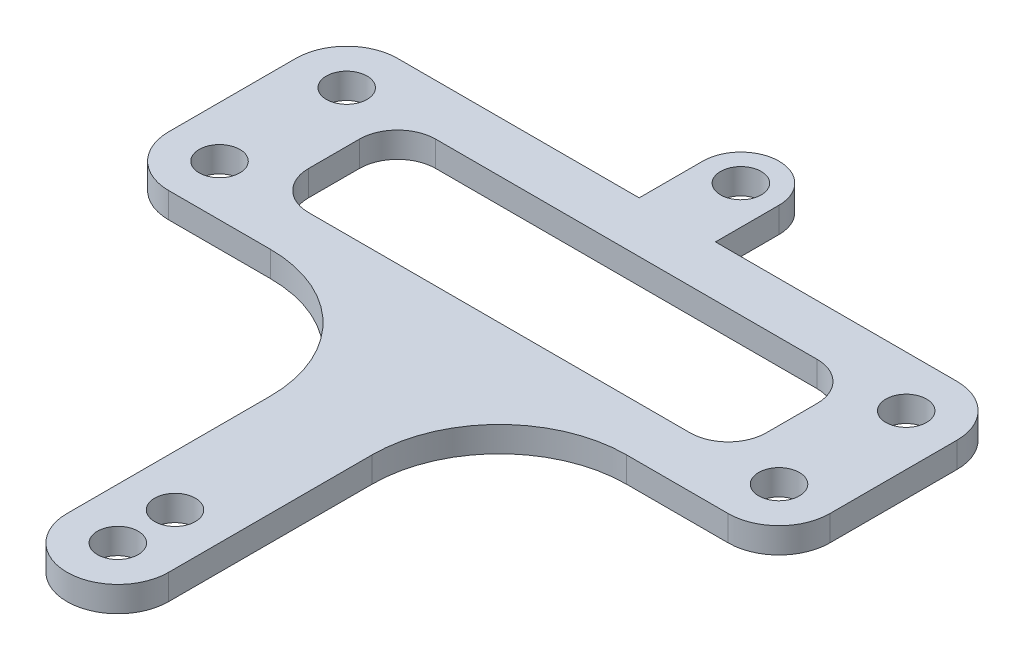
ISO-10303-21;
HEADER;
FILE_DESCRIPTION(('STEP AP214'),'2;1');
FILE_NAME('part.step','',(''),(''),'','','');
FILE_SCHEMA(('AUTOMOTIVE_DESIGN { 1 0 10303 214 1 1 1 1 }'));
ENDSEC;
DATA;
#1=APPLICATION_CONTEXT('core data for automotive mechanical design processes');
#2=APPLICATION_PROTOCOL_DEFINITION('international standard','automotive_design',2000,#1);
#3=PRODUCT_CONTEXT('',#1,'mechanical');
#4=PRODUCT('Part','Part','',(#3));
#5=PRODUCT_RELATED_PRODUCT_CATEGORY('part','',(#4));
#6=PRODUCT_DEFINITION_FORMATION('','',#4);
#7=PRODUCT_DEFINITION_CONTEXT('part definition',#1,'design');
#8=PRODUCT_DEFINITION('design','',#6,#7);
#9=PRODUCT_DEFINITION_SHAPE('','',#8);
#10=(LENGTH_UNIT() NAMED_UNIT(*) SI_UNIT(.MILLI.,.METRE.));
#11=(NAMED_UNIT(*) PLANE_ANGLE_UNIT() SI_UNIT($,.RADIAN.));
#12=(NAMED_UNIT(*) SI_UNIT($,.STERADIAN.) SOLID_ANGLE_UNIT());
#13=UNCERTAINTY_MEASURE_WITH_UNIT(LENGTH_MEASURE(1.E-05),#10,'distance_accuracy_value','');
#14=(GEOMETRIC_REPRESENTATION_CONTEXT(3) GLOBAL_UNCERTAINTY_ASSIGNED_CONTEXT((#13)) GLOBAL_UNIT_ASSIGNED_CONTEXT((#10,
#11,#12)) REPRESENTATION_CONTEXT('',''));
#15=CARTESIAN_POINT('',(0.,0.,0.));
#16=DIRECTION('',(0.,0.,1.));
#17=DIRECTION('',(1.,0.,0.));
#18=AXIS2_PLACEMENT_3D('',#15,#16,#17);
#19=CARTESIAN_POINT('',(0.,2.,0.));
#20=DIRECTION('',(0.,1.,0.));
#21=DIRECTION('',(0.,0.,1.));
#22=AXIS2_PLACEMENT_3D('',#19,#20,#21);
#23=PLANE('',#22);
#24=CARTESIAN_POINT('',(0.,2.,40.5));
#25=DIRECTION('',(0.,1.,0.));
#26=DIRECTION('',(0.,0.,1.));
#27=AXIS2_PLACEMENT_3D('',#24,#25,#26);
#28=CIRCLE('',#27,1.6);
#29=CARTESIAN_POINT('',(0.,2.,42.1));
#30=VERTEX_POINT('',#29);
#31=EDGE_CURVE('E943',#30,#30,#28,.T.);
#32=ORIENTED_EDGE('',*,*,#31,.F.);
#33=EDGE_LOOP('',(#32));
#34=FACE_BOUND('',#33,.T.);
#35=CARTESIAN_POINT('',(0.,2.,45.));
#36=DIRECTION('',(0.,1.,0.));
#37=DIRECTION('',(0.,0.,1.));
#38=AXIS2_PLACEMENT_3D('',#35,#36,#37);
#39=CIRCLE('',#38,1.6);
#40=CARTESIAN_POINT('',(0.,2.,46.6));
#41=VERTEX_POINT('',#40);
#42=EDGE_CURVE('E948',#41,#41,#39,.T.);
#43=ORIENTED_EDGE('',*,*,#42,.F.);
#44=EDGE_LOOP('',(#43));
#45=FACE_BOUND('',#44,.T.);
#46=CARTESIAN_POINT('',(-14.,2.,29.));
#47=DIRECTION('',(0.,1.,0.));
#48=DIRECTION('',(0.,0.,1.));
#49=AXIS2_PLACEMENT_3D('',#46,#47,#48);
#50=CIRCLE('',#49,10.);
#51=CARTESIAN_POINT('',(-14.,2.,19.));
#52=VERTEX_POINT('',#51);
#53=CARTESIAN_POINT('',(-4.,2.,29.));
#54=VERTEX_POINT('',#53);
#55=EDGE_CURVE('E416',#52,#54,#50,.F.);
#56=ORIENTED_EDGE('',*,*,#55,.T.);
#57=DIRECTION('',(0.,0.,-1.));
#58=VECTOR('',#57,1.);
#59=CARTESIAN_POINT('',(-3.99999999999999,2.,0.));
#60=LINE('',#59,#58);
#61=CARTESIAN_POINT('',(-4.,2.,45.));
#62=VERTEX_POINT('',#61);
#63=EDGE_CURVE('E303',#62,#54,#60,.T.);
#64=ORIENTED_EDGE('',*,*,#63,.F.);
#65=CARTESIAN_POINT('',(0.,2.,45.));
#66=DIRECTION('',(0.,1.,0.));
#67=DIRECTION('',(0.,0.,1.));
#68=AXIS2_PLACEMENT_3D('',#65,#66,#67);
#69=CIRCLE('',#68,4.);
#70=CARTESIAN_POINT('',(4.,2.,45.));
#71=VERTEX_POINT('',#70);
#72=EDGE_CURVE('E306',#62,#71,#69,.T.);
#73=ORIENTED_EDGE('',*,*,#72,.T.);
#74=DIRECTION('',(0.,0.,-1.));
#75=VECTOR('',#74,1.);
#76=CARTESIAN_POINT('',(4.00000000000001,2.,0.));
#77=LINE('',#76,#75);
#78=CARTESIAN_POINT('',(4.,2.,29.));
#79=VERTEX_POINT('',#78);
#80=EDGE_CURVE('E309',#71,#79,#77,.T.);
#81=ORIENTED_EDGE('',*,*,#80,.T.);
#82=CARTESIAN_POINT('',(14.,2.,29.));
#83=DIRECTION('',(0.,1.,0.));
#84=DIRECTION('',(0.,0.,1.));
#85=AXIS2_PLACEMENT_3D('',#82,#83,#84);
#86=CIRCLE('',#85,10.);
#87=CARTESIAN_POINT('',(14.,2.,19.));
#88=VERTEX_POINT('',#87);
#89=EDGE_CURVE('E420',#79,#88,#86,.F.);
#90=ORIENTED_EDGE('',*,*,#89,.T.);
#91=DIRECTION('',(-1.,0.,0.));
#92=VECTOR('',#91,1.);
#93=CARTESIAN_POINT('',(0.,2.,19.));
#94=LINE('',#93,#92);
#95=CARTESIAN_POINT('',(22.,2.,19.));
#96=VERTEX_POINT('',#95);
#97=EDGE_CURVE('E312',#96,#88,#94,.T.);
#98=ORIENTED_EDGE('',*,*,#97,.F.);
#99=CARTESIAN_POINT('',(22.,2.,15.));
#100=DIRECTION('',(0.,1.,0.));
#101=DIRECTION('',(0.,0.,1.));
#102=AXIS2_PLACEMENT_3D('',#99,#100,#101);
#103=CIRCLE('',#102,4.);
#104=CARTESIAN_POINT('',(26.,2.,15.));
#105=VERTEX_POINT('',#104);
#106=EDGE_CURVE('E315',#96,#105,#103,.T.);
#107=ORIENTED_EDGE('',*,*,#106,.T.);
#108=DIRECTION('',(0.,0.,1.));
#109=VECTOR('',#108,1.);
#110=CARTESIAN_POINT('',(26.,2.,0.));
#111=LINE('',#110,#109);
#112=CARTESIAN_POINT('',(26.,2.,5.));
#113=VERTEX_POINT('',#112);
#114=EDGE_CURVE('E317',#113,#105,#111,.T.);
#115=ORIENTED_EDGE('',*,*,#114,.F.);
#116=CARTESIAN_POINT('',(22.,2.,5.));
#117=DIRECTION('',(0.,1.,0.));
#118=DIRECTION('',(0.,0.,1.));
#119=AXIS2_PLACEMENT_3D('',#116,#117,#118);
#120=CIRCLE('',#119,4.);
#121=CARTESIAN_POINT('',(22.,2.,1.));
#122=VERTEX_POINT('',#121);
#123=EDGE_CURVE('E320',#113,#122,#120,.T.);
#124=ORIENTED_EDGE('',*,*,#123,.T.);
#125=DIRECTION('',(-1.,0.,0.));
#126=VECTOR('',#125,1.);
#127=CARTESIAN_POINT('',(0.,2.,1.));
#128=LINE('',#127,#126);
#129=CARTESIAN_POINT('',(3.,2.,1.));
#130=VERTEX_POINT('',#129);
#131=EDGE_CURVE('E243',#122,#130,#128,.T.);
#132=ORIENTED_EDGE('',*,*,#131,.T.);
#133=DIRECTION('',(0.,0.,-1.));
#134=VECTOR('',#133,1.);
#135=CARTESIAN_POINT('',(3.,2.,1.));
#136=LINE('',#135,#134);
#137=CARTESIAN_POINT('',(3.,2.,-4.));
#138=VERTEX_POINT('',#137);
#139=EDGE_CURVE('E236',#130,#138,#136,.T.);
#140=ORIENTED_EDGE('',*,*,#139,.T.);
#141=CARTESIAN_POINT('',(0.,2.,-4.));
#142=DIRECTION('',(0.,1.,0.));
#143=DIRECTION('',(0.,0.,1.));
#144=AXIS2_PLACEMENT_3D('',#141,#142,#143);
#145=CIRCLE('',#144,3.);
#146=CARTESIAN_POINT('',(-3.,2.,-4.));
#147=VERTEX_POINT('',#146);
#148=EDGE_CURVE('E241',#138,#147,#145,.T.);
#149=ORIENTED_EDGE('',*,*,#148,.T.);
#150=DIRECTION('',(0.,0.,1.));
#151=VECTOR('',#150,1.);
#152=CARTESIAN_POINT('',(-3.,2.,1.00000000000002));
#153=LINE('',#152,#151);
#154=CARTESIAN_POINT('',(-3.,2.,1.00000000000002));
#155=VERTEX_POINT('',#154);
#156=EDGE_CURVE('E246',#147,#155,#153,.T.);
#157=ORIENTED_EDGE('',*,*,#156,.T.);
#158=CARTESIAN_POINT('',(-22.,2.,1.00000000000001));
#159=VERTEX_POINT('',#158);
#160=EDGE_CURVE('E322',#155,#159,#128,.T.);
#161=ORIENTED_EDGE('',*,*,#160,.T.);
#162=CARTESIAN_POINT('',(-22.,2.,5.00000000000001));
#163=DIRECTION('',(0.,1.,0.));
#164=DIRECTION('',(0.,0.,1.));
#165=AXIS2_PLACEMENT_3D('',#162,#163,#164);
#166=CIRCLE('',#165,4.);
#167=CARTESIAN_POINT('',(-26.,2.,5.00000000000001));
#168=VERTEX_POINT('',#167);
#169=EDGE_CURVE('E324',#168,#159,#166,.F.);
#170=ORIENTED_EDGE('',*,*,#169,.F.);
#171=DIRECTION('',(0.,0.,1.));
#172=VECTOR('',#171,1.);
#173=CARTESIAN_POINT('',(-26.,2.,0.));
#174=LINE('',#173,#172);
#175=CARTESIAN_POINT('',(-26.,2.,15.));
#176=VERTEX_POINT('',#175);
#177=EDGE_CURVE('E327',#168,#176,#174,.T.);
#178=ORIENTED_EDGE('',*,*,#177,.T.);
#179=CARTESIAN_POINT('',(-22.,2.,15.));
#180=DIRECTION('',(0.,1.,0.));
#181=DIRECTION('',(0.,0.,1.));
#182=AXIS2_PLACEMENT_3D('',#179,#180,#181);
#183=CIRCLE('',#182,4.);
#184=CARTESIAN_POINT('',(-22.,2.,19.));
#185=VERTEX_POINT('',#184);
#186=EDGE_CURVE('E329',#185,#176,#183,.F.);
#187=ORIENTED_EDGE('',*,*,#186,.F.);
#188=DIRECTION('',(1.,0.,0.));
#189=VECTOR('',#188,1.);
#190=CARTESIAN_POINT('',(0.,2.,19.));
#191=LINE('',#190,#189);
#192=EDGE_CURVE('E332',#185,#52,#191,.T.);
#193=ORIENTED_EDGE('',*,*,#192,.T.);
#194=EDGE_LOOP('',(#56,#64,#73,#81,#90,#98,#107,#115,#124,#132,#140,#149,#157,#161,#170,#178,
#187,#193));
#195=FACE_BOUND('',#194,.T.);
#196=CARTESIAN_POINT('',(0.,2.,-4.));
#197=DIRECTION('',(0.,1.,0.));
#198=DIRECTION('',(0.,0.,1.));
#199=AXIS2_PLACEMENT_3D('',#196,#197,#198);
#200=CIRCLE('',#199,1.6);
#201=CARTESIAN_POINT('',(0.,2.,-2.4));
#202=VERTEX_POINT('',#201);
#203=EDGE_CURVE('E265',#202,#202,#200,.T.);
#204=ORIENTED_EDGE('',*,*,#203,.F.);
#205=EDGE_LOOP('',(#204));
#206=FACE_BOUND('',#205,.T.);
#207=CARTESIAN_POINT('',(-22.,2.,5.00000000000001));
#208=DIRECTION('',(0.,1.,0.));
#209=DIRECTION('',(0.,0.,1.));
#210=AXIS2_PLACEMENT_3D('',#207,#208,#209);
#211=CIRCLE('',#210,1.6);
#212=CARTESIAN_POINT('',(-22.,2.,6.60000000000001));
#213=VERTEX_POINT('',#212);
#214=EDGE_CURVE('E290',#213,#213,#211,.F.);
#215=ORIENTED_EDGE('',*,*,#214,.T.);
#216=EDGE_LOOP('',(#215));
#217=FACE_BOUND('',#216,.T.);
#218=CARTESIAN_POINT('',(22.,2.,5.));
#219=DIRECTION('',(0.,1.,0.));
#220=DIRECTION('',(0.,0.,1.));
#221=AXIS2_PLACEMENT_3D('',#218,#219,#220);
#222=CIRCLE('',#221,1.6);
#223=CARTESIAN_POINT('',(22.,2.,6.6));
#224=VERTEX_POINT('',#223);
#225=EDGE_CURVE('E293',#224,#224,#222,.T.);
#226=ORIENTED_EDGE('',*,*,#225,.F.);
#227=EDGE_LOOP('',(#226));
#228=FACE_BOUND('',#227,.T.);
#229=CARTESIAN_POINT('',(22.,2.,15.));
#230=DIRECTION('',(0.,1.,0.));
#231=DIRECTION('',(0.,0.,1.));
#232=AXIS2_PLACEMENT_3D('',#229,#230,#231);
#233=CIRCLE('',#232,1.6);
#234=CARTESIAN_POINT('',(22.,2.,16.6));
#235=VERTEX_POINT('',#234);
#236=EDGE_CURVE('E297',#235,#235,#233,.T.);
#237=ORIENTED_EDGE('',*,*,#236,.F.);
#238=EDGE_LOOP('',(#237));
#239=FACE_BOUND('',#238,.T.);
#240=CARTESIAN_POINT('',(-22.,2.,15.));
#241=DIRECTION('',(0.,1.,0.));
#242=DIRECTION('',(0.,0.,1.));
#243=AXIS2_PLACEMENT_3D('',#240,#241,#242);
#244=CIRCLE('',#243,1.6);
#245=CARTESIAN_POINT('',(-22.,2.,16.6));
#246=VERTEX_POINT('',#245);
#247=EDGE_CURVE('E300',#246,#246,#244,.F.);
#248=ORIENTED_EDGE('',*,*,#247,.T.);
#249=EDGE_LOOP('',(#248));
#250=FACE_BOUND('',#249,.T.);
#251=DIRECTION('',(0.,0.,1.));
#252=VECTOR('',#251,1.);
#253=CARTESIAN_POINT('',(-18.,2.,0.));
#254=LINE('',#253,#252);
#255=CARTESIAN_POINT('',(-18.,2.,8.00000000000001));
#256=VERTEX_POINT('',#255);
#257=CARTESIAN_POINT('',(-18.,2.,12.));
#258=VERTEX_POINT('',#257);
#259=EDGE_CURVE('E277',#256,#258,#254,.T.);
#260=ORIENTED_EDGE('',*,*,#259,.F.);
#261=CARTESIAN_POINT('',(-15.,2.,8.00000000000001));
#262=DIRECTION('',(0.,1.,0.));
#263=DIRECTION('',(0.,0.,1.));
#264=AXIS2_PLACEMENT_3D('',#261,#262,#263);
#265=CIRCLE('',#264,3.);
#266=CARTESIAN_POINT('',(-15.,2.,5.));
#267=VERTEX_POINT('',#266);
#268=EDGE_CURVE('E70',#256,#267,#265,.F.);
#269=ORIENTED_EDGE('',*,*,#268,.T.);
#270=DIRECTION('',(1.,0.,0.));
#271=VECTOR('',#270,1.);
#272=CARTESIAN_POINT('',(0.,2.,5.));
#273=LINE('',#272,#271);
#274=CARTESIAN_POINT('',(15.,2.,5.));
#275=VERTEX_POINT('',#274);
#276=EDGE_CURVE('E271',#267,#275,#273,.T.);
#277=ORIENTED_EDGE('',*,*,#276,.T.);
#278=CARTESIAN_POINT('',(15.,2.,8.));
#279=DIRECTION('',(0.,1.,0.));
#280=DIRECTION('',(0.,0.,1.));
#281=AXIS2_PLACEMENT_3D('',#278,#279,#280);
#282=CIRCLE('',#281,3.);
#283=CARTESIAN_POINT('',(18.,2.,8.));
#284=VERTEX_POINT('',#283);
#285=EDGE_CURVE('E452',#275,#284,#282,.F.);
#286=ORIENTED_EDGE('',*,*,#285,.T.);
#287=DIRECTION('',(0.,0.,1.));
#288=VECTOR('',#287,1.);
#289=CARTESIAN_POINT('',(18.,2.,0.));
#290=LINE('',#289,#288);
#291=CARTESIAN_POINT('',(18.,2.,12.));
#292=VERTEX_POINT('',#291);
#293=EDGE_CURVE('E282',#284,#292,#290,.T.);
#294=ORIENTED_EDGE('',*,*,#293,.T.);
#295=CARTESIAN_POINT('',(15.,2.,12.));
#296=DIRECTION('',(0.,1.,0.));
#297=DIRECTION('',(0.,0.,1.));
#298=AXIS2_PLACEMENT_3D('',#295,#296,#297);
#299=CIRCLE('',#298,3.);
#300=CARTESIAN_POINT('',(15.,2.,15.));
#301=VERTEX_POINT('',#300);
#302=EDGE_CURVE('E456',#292,#301,#299,.F.);
#303=ORIENTED_EDGE('',*,*,#302,.T.);
#304=DIRECTION('',(-1.,0.,0.));
#305=VECTOR('',#304,1.);
#306=CARTESIAN_POINT('',(0.,2.,15.));
#307=LINE('',#306,#305);
#308=CARTESIAN_POINT('',(-15.,2.,15.));
#309=VERTEX_POINT('',#308);
#310=EDGE_CURVE('E279',#301,#309,#307,.T.);
#311=ORIENTED_EDGE('',*,*,#310,.T.);
#312=CARTESIAN_POINT('',(-15.,2.,12.));
#313=DIRECTION('',(0.,1.,0.));
#314=DIRECTION('',(0.,0.,1.));
#315=AXIS2_PLACEMENT_3D('',#312,#313,#314);
#316=CIRCLE('',#315,3.);
#317=EDGE_CURVE('E460',#309,#258,#316,.F.);
#318=ORIENTED_EDGE('',*,*,#317,.T.);
#319=EDGE_LOOP('',(#260,#269,#277,#286,#294,#303,#311,#318));
#320=FACE_BOUND('',#319,.T.);
#321=ADVANCED_FACE('F61',(#34,#45,#195,#206,#217,#228,#239,#250,#320),#23,.T.);
#322=CARTESIAN_POINT('',(0.,0.,0.));
#323=DIRECTION('',(0.,1.,0.));
#324=DIRECTION('',(0.,0.,1.));
#325=AXIS2_PLACEMENT_3D('',#322,#323,#324);
#326=PLANE('',#325);
#327=CARTESIAN_POINT('',(0.,0.,40.5));
#328=DIRECTION('',(0.,-1.,0.));
#329=DIRECTION('',(0.,0.,-1.));
#330=AXIS2_PLACEMENT_3D('',#327,#328,#329);
#331=CIRCLE('',#330,1.6);
#332=CARTESIAN_POINT('',(0.,0.,38.9));
#333=VERTEX_POINT('',#332);
#334=EDGE_CURVE('E946',#333,#333,#331,.T.);
#335=ORIENTED_EDGE('',*,*,#334,.F.);
#336=EDGE_LOOP('',(#335));
#337=FACE_BOUND('',#336,.T.);
#338=CARTESIAN_POINT('',(0.,0.,45.));
#339=DIRECTION('',(0.,1.,0.));
#340=DIRECTION('',(0.,0.,1.));
#341=AXIS2_PLACEMENT_3D('',#338,#339,#340);
#342=CIRCLE('',#341,1.6);
#343=CARTESIAN_POINT('',(0.,0.,46.6));
#344=VERTEX_POINT('',#343);
#345=EDGE_CURVE('E65',#344,#344,#342,.T.);
#346=ORIENTED_EDGE('',*,*,#345,.T.);
#347=EDGE_LOOP('',(#346));
#348=FACE_BOUND('',#347,.T.);
#349=DIRECTION('',(0.,0.,-1.));
#350=VECTOR('',#349,1.);
#351=CARTESIAN_POINT('',(-3.99999999999999,0.,0.));
#352=LINE('',#351,#350);
#353=CARTESIAN_POINT('',(-4.,0.,45.));
#354=VERTEX_POINT('',#353);
#355=CARTESIAN_POINT('',(-4.,0.,29.));
#356=VERTEX_POINT('',#355);
#357=EDGE_CURVE('E347',#354,#356,#352,.T.);
#358=ORIENTED_EDGE('',*,*,#357,.T.);
#359=CARTESIAN_POINT('',(-14.,0.,29.));
#360=DIRECTION('',(0.,1.,0.));
#361=DIRECTION('',(0.,0.,1.));
#362=AXIS2_PLACEMENT_3D('',#359,#360,#361);
#363=CIRCLE('',#362,10.);
#364=CARTESIAN_POINT('',(-14.,0.,19.));
#365=VERTEX_POINT('',#364);
#366=EDGE_CURVE('E414',#356,#365,#363,.T.);
#367=ORIENTED_EDGE('',*,*,#366,.T.);
#368=DIRECTION('',(1.,0.,0.));
#369=VECTOR('',#368,1.);
#370=CARTESIAN_POINT('',(0.,0.,19.));
#371=LINE('',#370,#369);
#372=CARTESIAN_POINT('',(-22.,0.,19.));
#373=VERTEX_POINT('',#372);
#374=EDGE_CURVE('E294',#373,#365,#371,.T.);
#375=ORIENTED_EDGE('',*,*,#374,.F.);
#376=CARTESIAN_POINT('',(-22.,0.,15.));
#377=DIRECTION('',(0.,1.,0.));
#378=DIRECTION('',(0.,0.,1.));
#379=AXIS2_PLACEMENT_3D('',#376,#377,#378);
#380=CIRCLE('',#379,4.);
#381=CARTESIAN_POINT('',(-26.,0.,15.));
#382=VERTEX_POINT('',#381);
#383=EDGE_CURVE('E378',#373,#382,#380,.F.);
#384=ORIENTED_EDGE('',*,*,#383,.T.);
#385=DIRECTION('',(0.,0.,1.));
#386=VECTOR('',#385,1.);
#387=CARTESIAN_POINT('',(-26.,0.,0.));
#388=LINE('',#387,#386);
#389=CARTESIAN_POINT('',(-26.,0.,5.00000000000001));
#390=VERTEX_POINT('',#389);
#391=EDGE_CURVE('E375',#390,#382,#388,.T.);
#392=ORIENTED_EDGE('',*,*,#391,.F.);
#393=CARTESIAN_POINT('',(-22.,0.,5.00000000000001));
#394=DIRECTION('',(0.,1.,0.));
#395=DIRECTION('',(0.,0.,1.));
#396=AXIS2_PLACEMENT_3D('',#393,#394,#395);
#397=CIRCLE('',#396,4.);
#398=CARTESIAN_POINT('',(-22.,0.,1.00000000000001));
#399=VERTEX_POINT('',#398);
#400=EDGE_CURVE('E372',#390,#399,#397,.F.);
#401=ORIENTED_EDGE('',*,*,#400,.T.);
#402=DIRECTION('',(1.,0.,0.));
#403=VECTOR('',#402,1.);
#404=CARTESIAN_POINT('',(0.,0.,1.));
#405=LINE('',#404,#403);
#406=CARTESIAN_POINT('',(-3.,0.,1.00000000000002));
#407=VERTEX_POINT('',#406);
#408=EDGE_CURVE('E369',#399,#407,#405,.T.);
#409=ORIENTED_EDGE('',*,*,#408,.T.);
#410=DIRECTION('',(0.,0.,-1.));
#411=VECTOR('',#410,1.);
#412=CARTESIAN_POINT('',(-3.,0.,1.00000000000002));
#413=LINE('',#412,#411);
#414=CARTESIAN_POINT('',(-3.,0.,-4.));
#415=VERTEX_POINT('',#414);
#416=EDGE_CURVE('E272',#407,#415,#413,.T.);
#417=ORIENTED_EDGE('',*,*,#416,.T.);
#418=CARTESIAN_POINT('',(0.,0.,-4.));
#419=DIRECTION('',(0.,1.,0.));
#420=DIRECTION('',(0.,0.,1.));
#421=AXIS2_PLACEMENT_3D('',#418,#419,#420);
#422=CIRCLE('',#421,3.);
#423=CARTESIAN_POINT('',(3.,0.,-4.));
#424=VERTEX_POINT('',#423);
#425=EDGE_CURVE('E247',#415,#424,#422,.F.);
#426=ORIENTED_EDGE('',*,*,#425,.T.);
#427=DIRECTION('',(0.,0.,1.));
#428=VECTOR('',#427,1.);
#429=CARTESIAN_POINT('',(3.,0.,1.));
#430=LINE('',#429,#428);
#431=CARTESIAN_POINT('',(3.,0.,1.));
#432=VERTEX_POINT('',#431);
#433=EDGE_CURVE('E253',#424,#432,#430,.T.);
#434=ORIENTED_EDGE('',*,*,#433,.T.);
#435=CARTESIAN_POINT('',(22.,0.,1.));
#436=VERTEX_POINT('',#435);
#437=EDGE_CURVE('E368',#432,#436,#405,.T.);
#438=ORIENTED_EDGE('',*,*,#437,.T.);
#439=CARTESIAN_POINT('',(22.,0.,5.));
#440=DIRECTION('',(0.,1.,0.));
#441=DIRECTION('',(0.,0.,1.));
#442=AXIS2_PLACEMENT_3D('',#439,#440,#441);
#443=CIRCLE('',#442,4.);
#444=CARTESIAN_POINT('',(26.,0.,5.));
#445=VERTEX_POINT('',#444);
#446=EDGE_CURVE('E365',#445,#436,#443,.T.);
#447=ORIENTED_EDGE('',*,*,#446,.F.);
#448=DIRECTION('',(0.,0.,1.));
#449=VECTOR('',#448,1.);
#450=CARTESIAN_POINT('',(26.,0.,0.));
#451=LINE('',#450,#449);
#452=CARTESIAN_POINT('',(26.,0.,15.));
#453=VERTEX_POINT('',#452);
#454=EDGE_CURVE('E362',#445,#453,#451,.T.);
#455=ORIENTED_EDGE('',*,*,#454,.T.);
#456=CARTESIAN_POINT('',(22.,0.,15.));
#457=DIRECTION('',(0.,1.,0.));
#458=DIRECTION('',(0.,0.,1.));
#459=AXIS2_PLACEMENT_3D('',#456,#457,#458);
#460=CIRCLE('',#459,4.);
#461=CARTESIAN_POINT('',(22.,0.,19.));
#462=VERTEX_POINT('',#461);
#463=EDGE_CURVE('E359',#462,#453,#460,.T.);
#464=ORIENTED_EDGE('',*,*,#463,.F.);
#465=DIRECTION('',(-1.,0.,0.));
#466=VECTOR('',#465,1.);
#467=CARTESIAN_POINT('',(0.,0.,19.));
#468=LINE('',#467,#466);
#469=CARTESIAN_POINT('',(14.,0.,19.));
#470=VERTEX_POINT('',#469);
#471=EDGE_CURVE('E356',#462,#470,#468,.T.);
#472=ORIENTED_EDGE('',*,*,#471,.T.);
#473=CARTESIAN_POINT('',(14.,0.,29.));
#474=DIRECTION('',(0.,1.,0.));
#475=DIRECTION('',(0.,0.,1.));
#476=AXIS2_PLACEMENT_3D('',#473,#474,#475);
#477=CIRCLE('',#476,10.);
#478=CARTESIAN_POINT('',(4.,0.,29.));
#479=VERTEX_POINT('',#478);
#480=EDGE_CURVE('E418',#470,#479,#477,.T.);
#481=ORIENTED_EDGE('',*,*,#480,.T.);
#482=DIRECTION('',(0.,0.,-1.));
#483=VECTOR('',#482,1.);
#484=CARTESIAN_POINT('',(4.00000000000001,0.,0.));
#485=LINE('',#484,#483);
#486=CARTESIAN_POINT('',(4.,0.,45.));
#487=VERTEX_POINT('',#486);
#488=EDGE_CURVE('E353',#487,#479,#485,.T.);
#489=ORIENTED_EDGE('',*,*,#488,.F.);
#490=CARTESIAN_POINT('',(0.,0.,45.));
#491=DIRECTION('',(0.,1.,0.));
#492=DIRECTION('',(0.,0.,1.));
#493=AXIS2_PLACEMENT_3D('',#490,#491,#492);
#494=CIRCLE('',#493,4.);
#495=EDGE_CURVE('E350',#354,#487,#494,.T.);
#496=ORIENTED_EDGE('',*,*,#495,.F.);
#497=EDGE_LOOP('',(#358,#367,#375,#384,#392,#401,#409,#417,#426,#434,#438,#447,#455,#464,#472,
#481,#489,#496));
#498=FACE_BOUND('',#497,.T.);
#499=CARTESIAN_POINT('',(0.,0.,-4.));
#500=DIRECTION('',(0.,1.,0.));
#501=DIRECTION('',(0.,0.,1.));
#502=AXIS2_PLACEMENT_3D('',#499,#500,#501);
#503=CIRCLE('',#502,1.6);
#504=CARTESIAN_POINT('',(0.,0.,-2.4));
#505=VERTEX_POINT('',#504);
#506=EDGE_CURVE('E262',#505,#505,#503,.T.);
#507=ORIENTED_EDGE('',*,*,#506,.T.);
#508=EDGE_LOOP('',(#507));
#509=FACE_BOUND('',#508,.T.);
#510=CARTESIAN_POINT('',(-22.,0.,15.));
#511=DIRECTION('',(0.,1.,0.));
#512=DIRECTION('',(0.,0.,1.));
#513=AXIS2_PLACEMENT_3D('',#510,#511,#512);
#514=CIRCLE('',#513,1.6);
#515=CARTESIAN_POINT('',(-22.,0.,16.6));
#516=VERTEX_POINT('',#515);
#517=EDGE_CURVE('E344',#516,#516,#514,.F.);
#518=ORIENTED_EDGE('',*,*,#517,.F.);
#519=EDGE_LOOP('',(#518));
#520=FACE_BOUND('',#519,.T.);
#521=CARTESIAN_POINT('',(22.,0.,15.));
#522=DIRECTION('',(0.,1.,0.));
#523=DIRECTION('',(0.,0.,1.));
#524=AXIS2_PLACEMENT_3D('',#521,#522,#523);
#525=CIRCLE('',#524,1.6);
#526=CARTESIAN_POINT('',(22.,0.,16.6));
#527=VERTEX_POINT('',#526);
#528=EDGE_CURVE('E341',#527,#527,#525,.T.);
#529=ORIENTED_EDGE('',*,*,#528,.T.);
#530=EDGE_LOOP('',(#529));
#531=FACE_BOUND('',#530,.T.);
#532=CARTESIAN_POINT('',(22.,0.,5.));
#533=DIRECTION('',(0.,1.,0.));
#534=DIRECTION('',(0.,0.,1.));
#535=AXIS2_PLACEMENT_3D('',#532,#533,#534);
#536=CIRCLE('',#535,1.6);
#537=CARTESIAN_POINT('',(22.,0.,6.6));
#538=VERTEX_POINT('',#537);
#539=EDGE_CURVE('E338',#538,#538,#536,.T.);
#540=ORIENTED_EDGE('',*,*,#539,.T.);
#541=EDGE_LOOP('',(#540));
#542=FACE_BOUND('',#541,.T.);
#543=CARTESIAN_POINT('',(-22.,0.,5.00000000000001));
#544=DIRECTION('',(0.,1.,0.));
#545=DIRECTION('',(0.,0.,1.));
#546=AXIS2_PLACEMENT_3D('',#543,#544,#545);
#547=CIRCLE('',#546,1.6);
#548=CARTESIAN_POINT('',(-22.,0.,6.60000000000001));
#549=VERTEX_POINT('',#548);
#550=EDGE_CURVE('E289',#549,#549,#547,.F.);
#551=ORIENTED_EDGE('',*,*,#550,.F.);
#552=EDGE_LOOP('',(#551));
#553=FACE_BOUND('',#552,.T.);
#554=DIRECTION('',(1.,0.,0.));
#555=VECTOR('',#554,1.);
#556=CARTESIAN_POINT('',(0.,0.,5.));
#557=LINE('',#556,#555);
#558=CARTESIAN_POINT('',(-15.,0.,5.));
#559=VERTEX_POINT('',#558);
#560=CARTESIAN_POINT('',(15.,0.,5.));
#561=VERTEX_POINT('',#560);
#562=EDGE_CURVE('E430',#559,#561,#557,.T.);
#563=ORIENTED_EDGE('',*,*,#562,.F.);
#564=CARTESIAN_POINT('',(-15.,0.,8.00000000000001));
#565=DIRECTION('',(0.,1.,0.));
#566=DIRECTION('',(0.,0.,1.));
#567=AXIS2_PLACEMENT_3D('',#564,#565,#566);
#568=CIRCLE('',#567,3.);
#569=CARTESIAN_POINT('',(-18.,0.,8.00000000000001));
#570=VERTEX_POINT('',#569);
#571=EDGE_CURVE('E12',#559,#570,#568,.T.);
#572=ORIENTED_EDGE('',*,*,#571,.T.);
#573=DIRECTION('',(0.,0.,1.));
#574=VECTOR('',#573,1.);
#575=CARTESIAN_POINT('',(-18.,0.,0.));
#576=LINE('',#575,#574);
#577=CARTESIAN_POINT('',(-18.,0.,12.));
#578=VERTEX_POINT('',#577);
#579=EDGE_CURVE('E422',#570,#578,#576,.T.);
#580=ORIENTED_EDGE('',*,*,#579,.T.);
#581=CARTESIAN_POINT('',(-15.,0.,12.));
#582=DIRECTION('',(0.,1.,0.));
#583=DIRECTION('',(0.,0.,1.));
#584=AXIS2_PLACEMENT_3D('',#581,#582,#583);
#585=CIRCLE('',#584,3.);
#586=CARTESIAN_POINT('',(-15.,0.,15.));
#587=VERTEX_POINT('',#586);
#588=EDGE_CURVE('E462',#578,#587,#585,.T.);
#589=ORIENTED_EDGE('',*,*,#588,.T.);
#590=DIRECTION('',(-1.,0.,0.));
#591=VECTOR('',#590,1.);
#592=CARTESIAN_POINT('',(0.,0.,15.));
#593=LINE('',#592,#591);
#594=CARTESIAN_POINT('',(15.,0.,15.));
#595=VERTEX_POINT('',#594);
#596=EDGE_CURVE('E424',#595,#587,#593,.T.);
#597=ORIENTED_EDGE('',*,*,#596,.F.);
#598=CARTESIAN_POINT('',(15.,0.,12.));
#599=DIRECTION('',(0.,1.,0.));
#600=DIRECTION('',(0.,0.,1.));
#601=AXIS2_PLACEMENT_3D('',#598,#599,#600);
#602=CIRCLE('',#601,3.);
#603=CARTESIAN_POINT('',(18.,0.,12.));
#604=VERTEX_POINT('',#603);
#605=EDGE_CURVE('E458',#595,#604,#602,.T.);
#606=ORIENTED_EDGE('',*,*,#605,.T.);
#607=DIRECTION('',(0.,0.,1.));
#608=VECTOR('',#607,1.);
#609=CARTESIAN_POINT('',(18.,0.,0.));
#610=LINE('',#609,#608);
#611=CARTESIAN_POINT('',(18.,0.,8.));
#612=VERTEX_POINT('',#611);
#613=EDGE_CURVE('E427',#612,#604,#610,.T.);
#614=ORIENTED_EDGE('',*,*,#613,.F.);
#615=CARTESIAN_POINT('',(15.,0.,8.));
#616=DIRECTION('',(0.,1.,0.));
#617=DIRECTION('',(0.,0.,1.));
#618=AXIS2_PLACEMENT_3D('',#615,#616,#617);
#619=CIRCLE('',#618,3.);
#620=EDGE_CURVE('E454',#612,#561,#619,.T.);
#621=ORIENTED_EDGE('',*,*,#620,.T.);
#622=EDGE_LOOP('',(#563,#572,#580,#589,#597,#606,#614,#621));
#623=FACE_BOUND('',#622,.T.);
#624=ADVANCED_FACE('F475',(#337,#348,#498,#509,#520,#531,#542,#553,#623),#326,.F.);
#625=CARTESIAN_POINT('',(0.,2.,1.));
#626=DIRECTION('',(0.,0.,-1.));
#627=DIRECTION('',(-1.,0.,0.));
#628=AXIS2_PLACEMENT_3D('',#625,#626,#627);
#629=PLANE('',#628);
#630=DIRECTION('',(0.,1.,0.));
#631=VECTOR('',#630,1.);
#632=CARTESIAN_POINT('',(-3.,-8.48528137423857,1.));
#633=LINE('',#632,#631);
#634=EDGE_CURVE('E287',#407,#155,#633,.T.);
#635=ORIENTED_EDGE('',*,*,#634,.F.);
#636=ORIENTED_EDGE('',*,*,#408,.F.);
#637=DIRECTION('',(0.,-1.,0.));
#638=VECTOR('',#637,1.);
#639=CARTESIAN_POINT('',(-22.,2.,1.00000000000001));
#640=LINE('',#639,#638);
#641=EDGE_CURVE('E388',#159,#399,#640,.T.);
#642=ORIENTED_EDGE('',*,*,#641,.F.);
#643=ORIENTED_EDGE('',*,*,#160,.F.);
#644=EDGE_LOOP('',(#635,#636,#642,#643));
#645=FACE_BOUND('',#644,.T.);
#646=ADVANCED_FACE('F511',(#645),#629,.T.);
#647=CARTESIAN_POINT('',(-3.99999999999999,2.,0.));
#648=DIRECTION('',(-1.,0.,0.));
#649=DIRECTION('',(0.,0.,1.));
#650=AXIS2_PLACEMENT_3D('',#647,#648,#649);
#651=PLANE('',#650);
#652=ORIENTED_EDGE('',*,*,#63,.T.);
#653=DIRECTION('',(0.,-1.,0.));
#654=VECTOR('',#653,1.);
#655=CARTESIAN_POINT('',(-4.,2.,29.));
#656=LINE('',#655,#654);
#657=EDGE_CURVE('E404',#54,#356,#656,.T.);
#658=ORIENTED_EDGE('',*,*,#657,.T.);
#659=ORIENTED_EDGE('',*,*,#357,.F.);
#660=DIRECTION('',(0.,-1.,0.));
#661=VECTOR('',#660,1.);
#662=CARTESIAN_POINT('',(-4.,2.,45.));
#663=LINE('',#662,#661);
#664=EDGE_CURVE('E402',#62,#354,#663,.T.);
#665=ORIENTED_EDGE('',*,*,#664,.F.);
#666=EDGE_LOOP('',(#652,#658,#659,#665));
#667=FACE_BOUND('',#666,.T.);
#668=ADVANCED_FACE('F564',(#667),#651,.T.);
#669=CARTESIAN_POINT('',(0.,2.,45.));
#670=DIRECTION('',(0.,-1.,0.));
#671=DIRECTION('',(0.,0.,-1.));
#672=AXIS2_PLACEMENT_3D('',#669,#670,#671);
#673=CYLINDRICAL_SURFACE('',#672,4.);
#674=ORIENTED_EDGE('',*,*,#495,.T.);
#675=DIRECTION('',(0.,-1.,0.));
#676=VECTOR('',#675,1.);
#677=CARTESIAN_POINT('',(4.,2.,45.));
#678=LINE('',#677,#676);
#679=EDGE_CURVE('E399',#71,#487,#678,.T.);
#680=ORIENTED_EDGE('',*,*,#679,.F.);
#681=ORIENTED_EDGE('',*,*,#72,.F.);
#682=ORIENTED_EDGE('',*,*,#664,.T.);
#683=EDGE_LOOP('',(#674,#680,#681,#682));
#684=FACE_BOUND('',#683,.T.);
#685=ADVANCED_FACE('F560',(#684),#673,.T.);
#686=CARTESIAN_POINT('',(4.00000000000001,2.,0.));
#687=DIRECTION('',(-1.,0.,0.));
#688=DIRECTION('',(0.,0.,1.));
#689=AXIS2_PLACEMENT_3D('',#686,#687,#688);
#690=PLANE('',#689);
#691=ORIENTED_EDGE('',*,*,#488,.T.);
#692=DIRECTION('',(0.,-1.,0.));
#693=VECTOR('',#692,1.);
#694=CARTESIAN_POINT('',(4.,2.,29.));
#695=LINE('',#694,#693);
#696=EDGE_CURVE('E412',#479,#79,#695,.F.);
#697=ORIENTED_EDGE('',*,*,#696,.T.);
#698=ORIENTED_EDGE('',*,*,#80,.F.);
#699=ORIENTED_EDGE('',*,*,#679,.T.);
#700=EDGE_LOOP('',(#691,#697,#698,#699));
#701=FACE_BOUND('',#700,.T.);
#702=ADVANCED_FACE('F556',(#701),#690,.F.);
#703=CARTESIAN_POINT('',(0.,2.,19.));
#704=DIRECTION('',(0.,0.,1.));
#705=DIRECTION('',(1.,0.,0.));
#706=AXIS2_PLACEMENT_3D('',#703,#704,#705);
#707=PLANE('',#706);
#708=ORIENTED_EDGE('',*,*,#97,.T.);
#709=DIRECTION('',(0.,-1.,0.));
#710=VECTOR('',#709,1.);
#711=CARTESIAN_POINT('',(14.,2.,19.));
#712=LINE('',#711,#710);
#713=EDGE_CURVE('E409',#88,#470,#712,.T.);
#714=ORIENTED_EDGE('',*,*,#713,.T.);
#715=ORIENTED_EDGE('',*,*,#471,.F.);
#716=DIRECTION('',(0.,-1.,0.));
#717=VECTOR('',#716,1.);
#718=CARTESIAN_POINT('',(22.,2.,19.));
#719=LINE('',#718,#717);
#720=EDGE_CURVE('E397',#96,#462,#719,.T.);
#721=ORIENTED_EDGE('',*,*,#720,.F.);
#722=EDGE_LOOP('',(#708,#714,#715,#721));
#723=FACE_BOUND('',#722,.T.);
#724=ADVANCED_FACE('F552',(#723),#707,.T.);
#725=CARTESIAN_POINT('',(22.,2.,15.));
#726=DIRECTION('',(0.,-1.,0.));
#727=DIRECTION('',(0.,0.,-1.));
#728=AXIS2_PLACEMENT_3D('',#725,#726,#727);
#729=CYLINDRICAL_SURFACE('',#728,4.);
#730=ORIENTED_EDGE('',*,*,#463,.T.);
#731=DIRECTION('',(0.,-1.,0.));
#732=VECTOR('',#731,1.);
#733=CARTESIAN_POINT('',(26.,2.,15.));
#734=LINE('',#733,#732);
#735=EDGE_CURVE('E395',#105,#453,#734,.T.);
#736=ORIENTED_EDGE('',*,*,#735,.F.);
#737=ORIENTED_EDGE('',*,*,#106,.F.);
#738=ORIENTED_EDGE('',*,*,#720,.T.);
#739=EDGE_LOOP('',(#730,#736,#737,#738));
#740=FACE_BOUND('',#739,.T.);
#741=ADVANCED_FACE('F548',(#740),#729,.T.);
#742=CARTESIAN_POINT('',(26.,2.,0.));
#743=DIRECTION('',(1.,0.,0.));
#744=DIRECTION('',(0.,0.,-1.));
#745=AXIS2_PLACEMENT_3D('',#742,#743,#744);
#746=PLANE('',#745);
#747=ORIENTED_EDGE('',*,*,#454,.F.);
#748=DIRECTION('',(0.,-1.,0.));
#749=VECTOR('',#748,1.);
#750=CARTESIAN_POINT('',(26.,2.,5.));
#751=LINE('',#750,#749);
#752=EDGE_CURVE('E393',#113,#445,#751,.T.);
#753=ORIENTED_EDGE('',*,*,#752,.F.);
#754=ORIENTED_EDGE('',*,*,#114,.T.);
#755=ORIENTED_EDGE('',*,*,#735,.T.);
#756=EDGE_LOOP('',(#747,#753,#754,#755));
#757=FACE_BOUND('',#756,.T.);
#758=ADVANCED_FACE('F544',(#757),#746,.T.);
#759=CARTESIAN_POINT('',(22.,2.,5.));
#760=DIRECTION('',(0.,-1.,0.));
#761=DIRECTION('',(0.,0.,-1.));
#762=AXIS2_PLACEMENT_3D('',#759,#760,#761);
#763=CYLINDRICAL_SURFACE('',#762,4.);
#764=ORIENTED_EDGE('',*,*,#446,.T.);
#765=DIRECTION('',(0.,-1.,0.));
#766=VECTOR('',#765,1.);
#767=CARTESIAN_POINT('',(22.,2.,1.));
#768=LINE('',#767,#766);
#769=EDGE_CURVE('E390',#122,#436,#768,.T.);
#770=ORIENTED_EDGE('',*,*,#769,.F.);
#771=ORIENTED_EDGE('',*,*,#123,.F.);
#772=ORIENTED_EDGE('',*,*,#752,.T.);
#773=EDGE_LOOP('',(#764,#770,#771,#772));
#774=FACE_BOUND('',#773,.T.);
#775=ADVANCED_FACE('F540',(#774),#763,.T.);
#776=DIRECTION('',(0.,1.,0.));
#777=VECTOR('',#776,1.);
#778=CARTESIAN_POINT('',(3.,-8.48528137423857,1.));
#779=LINE('',#778,#777);
#780=EDGE_CURVE('E285',#130,#432,#779,.F.);
#781=ORIENTED_EDGE('',*,*,#780,.F.);
#782=ORIENTED_EDGE('',*,*,#131,.F.);
#783=ORIENTED_EDGE('',*,*,#769,.T.);
#784=ORIENTED_EDGE('',*,*,#437,.F.);
#785=EDGE_LOOP('',(#781,#782,#783,#784));
#786=FACE_BOUND('',#785,.T.);
#787=ADVANCED_FACE('F536',(#786),#629,.T.);
#788=CARTESIAN_POINT('',(-22.,2.,5.00000000000001));
#789=DIRECTION('',(0.,-1.,0.));
#790=DIRECTION('',(0.,0.,-1.));
#791=AXIS2_PLACEMENT_3D('',#788,#789,#790);
#792=CYLINDRICAL_SURFACE('',#791,4.);
#793=ORIENTED_EDGE('',*,*,#400,.F.);
#794=DIRECTION('',(0.,-1.,0.));
#795=VECTOR('',#794,1.);
#796=CARTESIAN_POINT('',(-26.,2.,5.00000000000001));
#797=LINE('',#796,#795);
#798=EDGE_CURVE('E386',#168,#390,#797,.T.);
#799=ORIENTED_EDGE('',*,*,#798,.F.);
#800=ORIENTED_EDGE('',*,*,#169,.T.);
#801=ORIENTED_EDGE('',*,*,#641,.T.);
#802=EDGE_LOOP('',(#793,#799,#800,#801));
#803=FACE_BOUND('',#802,.T.);
#804=ADVANCED_FACE('F532',(#803),#792,.T.);
#805=CARTESIAN_POINT('',(-26.,2.,0.));
#806=DIRECTION('',(1.,0.,0.));
#807=DIRECTION('',(0.,0.,-1.));
#808=AXIS2_PLACEMENT_3D('',#805,#806,#807);
#809=PLANE('',#808);
#810=ORIENTED_EDGE('',*,*,#391,.T.);
#811=DIRECTION('',(0.,-1.,0.));
#812=VECTOR('',#811,1.);
#813=CARTESIAN_POINT('',(-26.,2.,15.));
#814=LINE('',#813,#812);
#815=EDGE_CURVE('E384',#176,#382,#814,.T.);
#816=ORIENTED_EDGE('',*,*,#815,.F.);
#817=ORIENTED_EDGE('',*,*,#177,.F.);
#818=ORIENTED_EDGE('',*,*,#798,.T.);
#819=EDGE_LOOP('',(#810,#816,#817,#818));
#820=FACE_BOUND('',#819,.T.);
#821=ADVANCED_FACE('F528',(#820),#809,.F.);
#822=CARTESIAN_POINT('',(-22.,2.,15.));
#823=DIRECTION('',(0.,-1.,0.));
#824=DIRECTION('',(0.,0.,-1.));
#825=AXIS2_PLACEMENT_3D('',#822,#823,#824);
#826=CYLINDRICAL_SURFACE('',#825,4.);
#827=ORIENTED_EDGE('',*,*,#383,.F.);
#828=DIRECTION('',(0.,-1.,0.));
#829=VECTOR('',#828,1.);
#830=CARTESIAN_POINT('',(-22.,2.,19.));
#831=LINE('',#830,#829);
#832=EDGE_CURVE('E335',#185,#373,#831,.T.);
#833=ORIENTED_EDGE('',*,*,#832,.F.);
#834=ORIENTED_EDGE('',*,*,#186,.T.);
#835=ORIENTED_EDGE('',*,*,#815,.T.);
#836=EDGE_LOOP('',(#827,#833,#834,#835));
#837=FACE_BOUND('',#836,.T.);
#838=ADVANCED_FACE('F524',(#837),#826,.T.);
#839=CARTESIAN_POINT('',(-22.,2.,15.));
#840=DIRECTION('',(0.,-1.,0.));
#841=DIRECTION('',(0.,0.,-1.));
#842=AXIS2_PLACEMENT_3D('',#839,#840,#841);
#843=CYLINDRICAL_SURFACE('',#842,1.6);
#844=ORIENTED_EDGE('',*,*,#247,.F.);
#845=EDGE_LOOP('',(#844));
#846=FACE_BOUND('',#845,.T.);
#847=ORIENTED_EDGE('',*,*,#517,.T.);
#848=EDGE_LOOP('',(#847));
#849=FACE_BOUND('',#848,.T.);
#850=ADVANCED_FACE('F527',(#846,#849),#843,.F.);
#851=CARTESIAN_POINT('',(22.,2.,15.));
#852=DIRECTION('',(0.,-1.,0.));
#853=DIRECTION('',(0.,0.,-1.));
#854=AXIS2_PLACEMENT_3D('',#851,#852,#853);
#855=CYLINDRICAL_SURFACE('',#854,1.6);
#856=ORIENTED_EDGE('',*,*,#236,.T.);
#857=EDGE_LOOP('',(#856));
#858=FACE_BOUND('',#857,.T.);
#859=ORIENTED_EDGE('',*,*,#528,.F.);
#860=EDGE_LOOP('',(#859));
#861=FACE_BOUND('',#860,.T.);
#862=ADVANCED_FACE('F571',(#858,#861),#855,.F.);
#863=CARTESIAN_POINT('',(22.,2.,5.));
#864=DIRECTION('',(0.,-1.,0.));
#865=DIRECTION('',(0.,0.,-1.));
#866=AXIS2_PLACEMENT_3D('',#863,#864,#865);
#867=CYLINDRICAL_SURFACE('',#866,1.6);
#868=ORIENTED_EDGE('',*,*,#225,.T.);
#869=EDGE_LOOP('',(#868));
#870=FACE_BOUND('',#869,.T.);
#871=ORIENTED_EDGE('',*,*,#539,.F.);
#872=EDGE_LOOP('',(#871));
#873=FACE_BOUND('',#872,.T.);
#874=ADVANCED_FACE('F575',(#870,#873),#867,.F.);
#875=CARTESIAN_POINT('',(-22.,2.,5.00000000000001));
#876=DIRECTION('',(0.,-1.,0.));
#877=DIRECTION('',(0.,0.,-1.));
#878=AXIS2_PLACEMENT_3D('',#875,#876,#877);
#879=CYLINDRICAL_SURFACE('',#878,1.6);
#880=ORIENTED_EDGE('',*,*,#214,.F.);
#881=EDGE_LOOP('',(#880));
#882=FACE_BOUND('',#881,.T.);
#883=ORIENTED_EDGE('',*,*,#550,.T.);
#884=EDGE_LOOP('',(#883));
#885=FACE_BOUND('',#884,.T.);
#886=ADVANCED_FACE('F522',(#882,#885),#879,.F.);
#887=CARTESIAN_POINT('',(0.,2.,19.));
#888=DIRECTION('',(0.,0.,-1.));
#889=DIRECTION('',(-1.,0.,0.));
#890=AXIS2_PLACEMENT_3D('',#887,#888,#889);
#891=PLANE('',#890);
#892=ORIENTED_EDGE('',*,*,#374,.T.);
#893=DIRECTION('',(0.,-1.,0.));
#894=VECTOR('',#893,1.);
#895=CARTESIAN_POINT('',(-14.,2.,19.));
#896=LINE('',#895,#894);
#897=EDGE_CURVE('E407',#365,#52,#896,.F.);
#898=ORIENTED_EDGE('',*,*,#897,.T.);
#899=ORIENTED_EDGE('',*,*,#192,.F.);
#900=ORIENTED_EDGE('',*,*,#832,.T.);
#901=EDGE_LOOP('',(#892,#898,#899,#900));
#902=FACE_BOUND('',#901,.T.);
#903=ADVANCED_FACE('F518',(#902),#891,.F.);
#904=CARTESIAN_POINT('',(-14.,2.,29.));
#905=DIRECTION('',(0.,-1.,0.));
#906=DIRECTION('',(0.,0.,-1.));
#907=AXIS2_PLACEMENT_3D('',#904,#905,#906);
#908=CYLINDRICAL_SURFACE('',#907,10.);
#909=ORIENTED_EDGE('',*,*,#55,.F.);
#910=ORIENTED_EDGE('',*,*,#897,.F.);
#911=ORIENTED_EDGE('',*,*,#366,.F.);
#912=ORIENTED_EDGE('',*,*,#657,.F.);
#913=EDGE_LOOP('',(#909,#910,#911,#912));
#914=FACE_BOUND('',#913,.T.);
#915=ADVANCED_FACE('F521',(#914),#908,.F.);
#916=CARTESIAN_POINT('',(14.,2.,29.));
#917=DIRECTION('',(0.,-1.,0.));
#918=DIRECTION('',(0.,0.,-1.));
#919=AXIS2_PLACEMENT_3D('',#916,#917,#918);
#920=CYLINDRICAL_SURFACE('',#919,10.);
#921=ORIENTED_EDGE('',*,*,#89,.F.);
#922=ORIENTED_EDGE('',*,*,#696,.F.);
#923=ORIENTED_EDGE('',*,*,#480,.F.);
#924=ORIENTED_EDGE('',*,*,#713,.F.);
#925=EDGE_LOOP('',(#921,#922,#923,#924));
#926=FACE_BOUND('',#925,.T.);
#927=ADVANCED_FACE('F584',(#926),#920,.F.);
#928=CARTESIAN_POINT('',(0.,-7.5,5.));
#929=DIRECTION('',(0.,0.,1.));
#930=DIRECTION('',(1.,0.,0.));
#931=AXIS2_PLACEMENT_3D('',#928,#929,#930);
#932=PLANE('',#931);
#933=ORIENTED_EDGE('',*,*,#562,.T.);
#934=DIRECTION('',(0.,1.,0.));
#935=VECTOR('',#934,1.);
#936=CARTESIAN_POINT('',(15.,2.,5.));
#937=LINE('',#936,#935);
#938=EDGE_CURVE('E435',#561,#275,#937,.T.);
#939=ORIENTED_EDGE('',*,*,#938,.T.);
#940=ORIENTED_EDGE('',*,*,#276,.F.);
#941=DIRECTION('',(0.,1.,0.));
#942=VECTOR('',#941,1.);
#943=CARTESIAN_POINT('',(-15.,-7.5,5.));
#944=LINE('',#943,#942);
#945=EDGE_CURVE('E433',#267,#559,#944,.F.);
#946=ORIENTED_EDGE('',*,*,#945,.T.);
#947=EDGE_LOOP('',(#933,#939,#940,#946));
#948=FACE_BOUND('',#947,.T.);
#949=ADVANCED_FACE('F471',(#948),#932,.T.);
#950=CARTESIAN_POINT('',(18.,-7.5,0.));
#951=DIRECTION('',(-1.,0.,0.));
#952=DIRECTION('',(0.,0.,1.));
#953=AXIS2_PLACEMENT_3D('',#950,#951,#952);
#954=PLANE('',#953);
#955=ORIENTED_EDGE('',*,*,#293,.F.);
#956=DIRECTION('',(0.,1.,0.));
#957=VECTOR('',#956,1.);
#958=CARTESIAN_POINT('',(18.,0.,8.));
#959=LINE('',#958,#957);
#960=EDGE_CURVE('E441',#284,#612,#959,.F.);
#961=ORIENTED_EDGE('',*,*,#960,.T.);
#962=ORIENTED_EDGE('',*,*,#613,.T.);
#963=DIRECTION('',(0.,1.,0.));
#964=VECTOR('',#963,1.);
#965=CARTESIAN_POINT('',(18.,2.,12.));
#966=LINE('',#965,#964);
#967=EDGE_CURVE('E438',#604,#292,#966,.T.);
#968=ORIENTED_EDGE('',*,*,#967,.T.);
#969=EDGE_LOOP('',(#955,#961,#962,#968));
#970=FACE_BOUND('',#969,.T.);
#971=ADVANCED_FACE('F490',(#970),#954,.T.);
#972=CARTESIAN_POINT('',(0.,-7.5,15.));
#973=DIRECTION('',(0.,0.,-1.));
#974=DIRECTION('',(-1.,0.,0.));
#975=AXIS2_PLACEMENT_3D('',#972,#973,#974);
#976=PLANE('',#975);
#977=ORIENTED_EDGE('',*,*,#310,.F.);
#978=DIRECTION('',(0.,1.,0.));
#979=VECTOR('',#978,1.);
#980=CARTESIAN_POINT('',(15.,0.,15.));
#981=LINE('',#980,#979);
#982=EDGE_CURVE('E446',#301,#595,#981,.F.);
#983=ORIENTED_EDGE('',*,*,#982,.T.);
#984=ORIENTED_EDGE('',*,*,#596,.T.);
#985=DIRECTION('',(0.,1.,0.));
#986=VECTOR('',#985,1.);
#987=CARTESIAN_POINT('',(-15.,-7.5,15.));
#988=LINE('',#987,#986);
#989=EDGE_CURVE('E443',#587,#309,#988,.T.);
#990=ORIENTED_EDGE('',*,*,#989,.T.);
#991=EDGE_LOOP('',(#977,#983,#984,#990));
#992=FACE_BOUND('',#991,.T.);
#993=ADVANCED_FACE('F482',(#992),#976,.T.);
#994=CARTESIAN_POINT('',(-18.,-7.5,0.));
#995=DIRECTION('',(-1.,0.,0.));
#996=DIRECTION('',(0.,0.,1.));
#997=AXIS2_PLACEMENT_3D('',#994,#995,#996);
#998=PLANE('',#997);
#999=ORIENTED_EDGE('',*,*,#259,.T.);
#1000=DIRECTION('',(0.,1.,0.));
#1001=VECTOR('',#1000,1.);
#1002=CARTESIAN_POINT('',(-18.,-7.5,12.));
#1003=LINE('',#1002,#1001);
#1004=EDGE_CURVE('E78',#258,#578,#1003,.F.);
#1005=ORIENTED_EDGE('',*,*,#1004,.T.);
#1006=ORIENTED_EDGE('',*,*,#579,.F.);
#1007=DIRECTION('',(0.,1.,0.));
#1008=VECTOR('',#1007,1.);
#1009=CARTESIAN_POINT('',(-18.,-7.5,8.00000000000001));
#1010=LINE('',#1009,#1008);
#1011=EDGE_CURVE('E448',#570,#256,#1010,.T.);
#1012=ORIENTED_EDGE('',*,*,#1011,.T.);
#1013=EDGE_LOOP('',(#999,#1005,#1006,#1012));
#1014=FACE_BOUND('',#1013,.T.);
#1015=ADVANCED_FACE('F473',(#1014),#998,.F.);
#1016=CARTESIAN_POINT('',(15.,-7.5,8.));
#1017=DIRECTION('',(0.,-1.,0.));
#1018=DIRECTION('',(0.,0.,-1.));
#1019=AXIS2_PLACEMENT_3D('',#1016,#1017,#1018);
#1020=CYLINDRICAL_SURFACE('',#1019,3.);
#1021=ORIENTED_EDGE('',*,*,#620,.F.);
#1022=ORIENTED_EDGE('',*,*,#960,.F.);
#1023=ORIENTED_EDGE('',*,*,#285,.F.);
#1024=ORIENTED_EDGE('',*,*,#938,.F.);
#1025=EDGE_LOOP('',(#1021,#1022,#1023,#1024));
#1026=FACE_BOUND('',#1025,.T.);
#1027=ADVANCED_FACE('F495',(#1026),#1020,.F.);
#1028=CARTESIAN_POINT('',(15.,-7.5,12.));
#1029=DIRECTION('',(0.,-1.,0.));
#1030=DIRECTION('',(0.,0.,-1.));
#1031=AXIS2_PLACEMENT_3D('',#1028,#1029,#1030);
#1032=CYLINDRICAL_SURFACE('',#1031,3.);
#1033=ORIENTED_EDGE('',*,*,#605,.F.);
#1034=ORIENTED_EDGE('',*,*,#982,.F.);
#1035=ORIENTED_EDGE('',*,*,#302,.F.);
#1036=ORIENTED_EDGE('',*,*,#967,.F.);
#1037=EDGE_LOOP('',(#1033,#1034,#1035,#1036));
#1038=FACE_BOUND('',#1037,.T.);
#1039=ADVANCED_FACE('F488',(#1038),#1032,.F.);
#1040=CARTESIAN_POINT('',(-15.,-7.5,12.));
#1041=DIRECTION('',(0.,1.,0.));
#1042=DIRECTION('',(0.,0.,1.));
#1043=AXIS2_PLACEMENT_3D('',#1040,#1041,#1042);
#1044=CYLINDRICAL_SURFACE('',#1043,3.);
#1045=ORIENTED_EDGE('',*,*,#588,.F.);
#1046=ORIENTED_EDGE('',*,*,#1004,.F.);
#1047=ORIENTED_EDGE('',*,*,#317,.F.);
#1048=ORIENTED_EDGE('',*,*,#989,.F.);
#1049=EDGE_LOOP('',(#1045,#1046,#1047,#1048));
#1050=FACE_BOUND('',#1049,.T.);
#1051=ADVANCED_FACE('F479',(#1050),#1044,.F.);
#1052=CARTESIAN_POINT('',(-15.,-7.5,8.00000000000001));
#1053=DIRECTION('',(0.,1.,0.));
#1054=DIRECTION('',(0.,0.,1.));
#1055=AXIS2_PLACEMENT_3D('',#1052,#1053,#1054);
#1056=CYLINDRICAL_SURFACE('',#1055,3.);
#1057=ORIENTED_EDGE('',*,*,#571,.F.);
#1058=ORIENTED_EDGE('',*,*,#945,.F.);
#1059=ORIENTED_EDGE('',*,*,#268,.F.);
#1060=ORIENTED_EDGE('',*,*,#1011,.F.);
#1061=EDGE_LOOP('',(#1057,#1058,#1059,#1060));
#1062=FACE_BOUND('',#1061,.T.);
#1063=ADVANCED_FACE('F63',(#1062),#1056,.F.);
#1064=CARTESIAN_POINT('',(3.,-9.21954445729291,1.));
#1065=DIRECTION('',(1.,0.,0.));
#1066=DIRECTION('',(0.,0.,-1.));
#1067=AXIS2_PLACEMENT_3D('',#1064,#1065,#1066);
#1068=PLANE('',#1067);
#1069=ORIENTED_EDGE('',*,*,#433,.F.);
#1070=DIRECTION('',(0.,1.,0.));
#1071=VECTOR('',#1070,1.);
#1072=CARTESIAN_POINT('',(3.,-8.48528137423857,-4.));
#1073=LINE('',#1072,#1071);
#1074=EDGE_CURVE('E250',#424,#138,#1073,.T.);
#1075=ORIENTED_EDGE('',*,*,#1074,.T.);
#1076=ORIENTED_EDGE('',*,*,#139,.F.);
#1077=ORIENTED_EDGE('',*,*,#780,.T.);
#1078=EDGE_LOOP('',(#1069,#1075,#1076,#1077));
#1079=FACE_BOUND('',#1078,.T.);
#1080=ADVANCED_FACE('F251',(#1079),#1068,.T.);
#1081=CARTESIAN_POINT('',(-3.,-9.21954445729291,1.00000000000002));
#1082=DIRECTION('',(-1.,0.,0.));
#1083=DIRECTION('',(0.,0.,1.));
#1084=AXIS2_PLACEMENT_3D('',#1081,#1082,#1083);
#1085=PLANE('',#1084);
#1086=ORIENTED_EDGE('',*,*,#416,.F.);
#1087=ORIENTED_EDGE('',*,*,#634,.T.);
#1088=ORIENTED_EDGE('',*,*,#156,.F.);
#1089=DIRECTION('',(0.,1.,0.));
#1090=VECTOR('',#1089,1.);
#1091=CARTESIAN_POINT('',(-3.,-8.48528137423857,-4.));
#1092=LINE('',#1091,#1090);
#1093=EDGE_CURVE('E257',#415,#147,#1092,.T.);
#1094=ORIENTED_EDGE('',*,*,#1093,.F.);
#1095=EDGE_LOOP('',(#1086,#1087,#1088,#1094));
#1096=FACE_BOUND('',#1095,.T.);
#1097=ADVANCED_FACE('F608',(#1096),#1085,.T.);
#1098=CARTESIAN_POINT('',(0.,-8.48528137423857,-4.));
#1099=DIRECTION('',(0.,1.,0.));
#1100=DIRECTION('',(0.,0.,1.));
#1101=AXIS2_PLACEMENT_3D('',#1098,#1099,#1100);
#1102=CYLINDRICAL_SURFACE('',#1101,3.);
#1103=ORIENTED_EDGE('',*,*,#425,.F.);
#1104=ORIENTED_EDGE('',*,*,#1093,.T.);
#1105=ORIENTED_EDGE('',*,*,#148,.F.);
#1106=ORIENTED_EDGE('',*,*,#1074,.F.);
#1107=EDGE_LOOP('',(#1103,#1104,#1105,#1106));
#1108=FACE_BOUND('',#1107,.T.);
#1109=ADVANCED_FACE('F260',(#1108),#1102,.T.);
#1110=CARTESIAN_POINT('',(0.,-3.5,-4.));
#1111=DIRECTION('',(0.,1.,0.));
#1112=DIRECTION('',(0.,0.,1.));
#1113=AXIS2_PLACEMENT_3D('',#1110,#1111,#1112);
#1114=CYLINDRICAL_SURFACE('',#1113,1.6);
#1115=ORIENTED_EDGE('',*,*,#203,.T.);
#1116=EDGE_LOOP('',(#1115));
#1117=FACE_BOUND('',#1116,.T.);
#1118=ORIENTED_EDGE('',*,*,#506,.F.);
#1119=EDGE_LOOP('',(#1118));
#1120=FACE_BOUND('',#1119,.T.);
#1121=ADVANCED_FACE('F783',(#1117,#1120),#1114,.F.);
#1122=CARTESIAN_POINT('',(0.,-8.,45.));
#1123=DIRECTION('',(0.,1.,0.));
#1124=DIRECTION('',(0.,0.,1.));
#1125=AXIS2_PLACEMENT_3D('',#1122,#1123,#1124);
#1126=CYLINDRICAL_SURFACE('',#1125,1.6);
#1127=ORIENTED_EDGE('',*,*,#42,.T.);
#1128=EDGE_LOOP('',(#1127));
#1129=FACE_BOUND('',#1128,.T.);
#1130=ORIENTED_EDGE('',*,*,#345,.F.);
#1131=EDGE_LOOP('',(#1130));
#1132=FACE_BOUND('',#1131,.T.);
#1133=ADVANCED_FACE('F790',(#1129,#1132),#1126,.F.);
#1134=CARTESIAN_POINT('',(0.,10.,40.5));
#1135=DIRECTION('',(0.,-1.,0.));
#1136=DIRECTION('',(0.,0.,-1.));
#1137=AXIS2_PLACEMENT_3D('',#1134,#1135,#1136);
#1138=CYLINDRICAL_SURFACE('',#1137,1.6);
#1139=ORIENTED_EDGE('',*,*,#31,.T.);
#1140=EDGE_LOOP('',(#1139));
#1141=FACE_BOUND('',#1140,.T.);
#1142=ORIENTED_EDGE('',*,*,#334,.T.);
#1143=EDGE_LOOP('',(#1142));
#1144=FACE_BOUND('',#1143,.T.);
#1145=ADVANCED_FACE('F798',(#1141,#1144),#1138,.F.);
#1146=CLOSED_SHELL('',(#321,#624,#646,#668,#685,#702,#724,#741,#758,#775,#787,#804,#821,#838,
#850,#862,#874,#886,#903,#915,#927,#949,#971,#993,#1015,#1027,#1039,#1051,#1063,#1080,#1097,
#1109,#1121,#1133,#1145));
#1147=MANIFOLD_SOLID_BREP('B2',#1146);
#1148=ADVANCED_BREP_SHAPE_REPRESENTATION('',(#18,#1147),#14);
#1149=SHAPE_DEFINITION_REPRESENTATION(#9,#1148);
ENDSEC;
END-ISO-10303-21;
